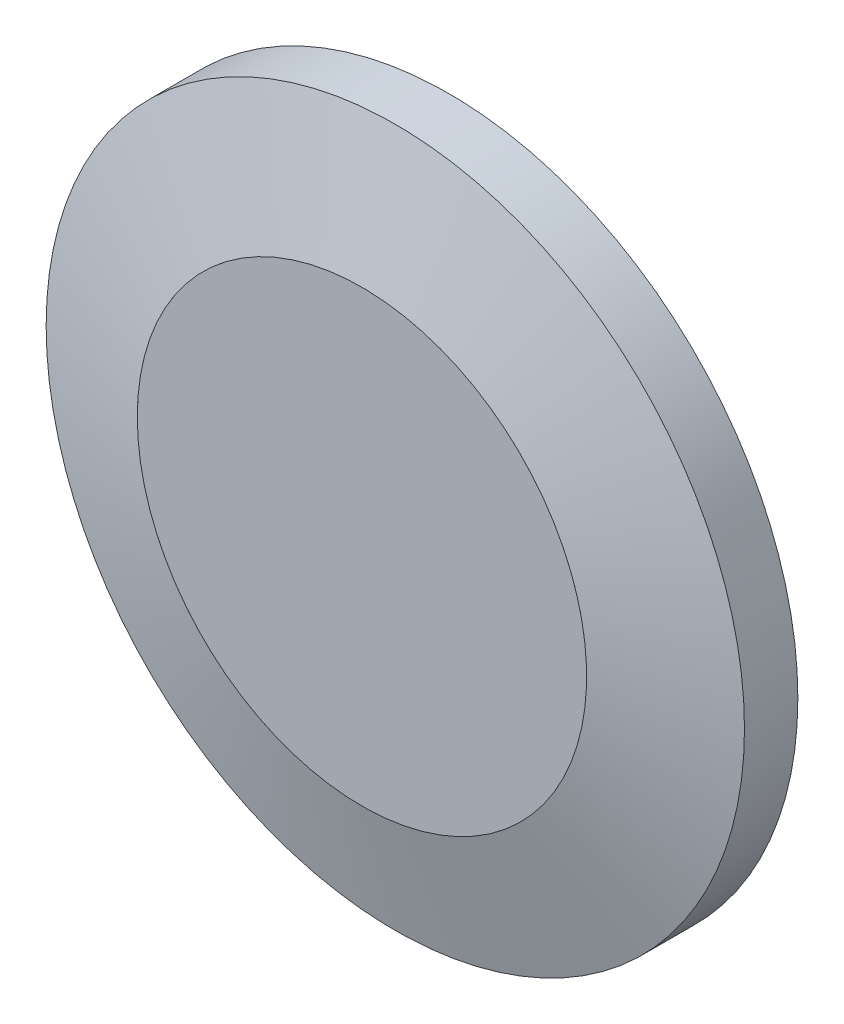
ISO-10303-21;
HEADER;
FILE_DESCRIPTION(('STEP AP214'),'2;1');
FILE_NAME('part.step','',(''),(''),'','','');
FILE_SCHEMA(('AUTOMOTIVE_DESIGN { 1 0 10303 214 1 1 1 1 }'));
ENDSEC;
DATA;
#1=APPLICATION_CONTEXT('core data for automotive mechanical design processes');
#2=APPLICATION_PROTOCOL_DEFINITION('international standard','automotive_design',2000,#1);
#3=PRODUCT_CONTEXT('',#1,'mechanical');
#4=PRODUCT('Part','Part','',(#3));
#5=PRODUCT_RELATED_PRODUCT_CATEGORY('part','',(#4));
#6=PRODUCT_DEFINITION_FORMATION('','',#4);
#7=PRODUCT_DEFINITION_CONTEXT('part definition',#1,'design');
#8=PRODUCT_DEFINITION('design','',#6,#7);
#9=PRODUCT_DEFINITION_SHAPE('','',#8);
#10=(LENGTH_UNIT() NAMED_UNIT(*) SI_UNIT(.MILLI.,.METRE.));
#11=(NAMED_UNIT(*) PLANE_ANGLE_UNIT() SI_UNIT($,.RADIAN.));
#12=(NAMED_UNIT(*) SI_UNIT($,.STERADIAN.) SOLID_ANGLE_UNIT());
#13=UNCERTAINTY_MEASURE_WITH_UNIT(LENGTH_MEASURE(1.E-05),#10,'distance_accuracy_value','');
#14=(GEOMETRIC_REPRESENTATION_CONTEXT(3) GLOBAL_UNCERTAINTY_ASSIGNED_CONTEXT((#13)) GLOBAL_UNIT_ASSIGNED_CONTEXT((#10,
#11,#12)) REPRESENTATION_CONTEXT('',''));
#15=CARTESIAN_POINT('',(0.,0.,0.));
#16=DIRECTION('',(0.,0.,1.));
#17=DIRECTION('',(1.,0.,0.));
#18=AXIS2_PLACEMENT_3D('',#15,#16,#17);
#19=CARTESIAN_POINT('',(0.,0.,2.4765));
#20=DIRECTION('',(0.,0.,-1.));
#21=DIRECTION('',(-1.,0.,0.));
#22=AXIS2_PLACEMENT_3D('',#19,#20,#21);
#23=PLANE('',#22);
#24=CARTESIAN_POINT('',(0.,0.,2.4765));
#25=DIRECTION('',(0.,0.,-1.));
#26=DIRECTION('',(-1.,0.,0.));
#27=AXIS2_PLACEMENT_3D('',#24,#25,#26);
#28=CIRCLE('',#27,12.8294432115813);
#29=CARTESIAN_POINT('',(-12.8294432115813,0.,2.4765));
#30=VERTEX_POINT('',#29);
#31=EDGE_CURVE('E31',#30,#30,#28,.T.);
#32=ORIENTED_EDGE('',*,*,#31,.F.);
#33=EDGE_LOOP('',(#32));
#34=FACE_BOUND('',#33,.T.);
#35=CARTESIAN_POINT('',(0.,0.,2.4765));
#36=DIRECTION('',(0.,0.,-1.));
#37=DIRECTION('',(0.,1.,0.));
#38=AXIS2_PLACEMENT_3D('',#35,#36,#37);
#39=CIRCLE('',#38,12.827);
#40=CARTESIAN_POINT('',(0.,12.827,2.4765));
#41=VERTEX_POINT('',#40);
#42=EDGE_CURVE('E10',#41,#41,#39,.T.);
#43=ORIENTED_EDGE('',*,*,#42,.T.);
#44=EDGE_LOOP('',(#43));
#45=FACE_BOUND('',#44,.T.);
#46=ADVANCED_FACE('F14',(#34,#45),#23,.F.);
#47=CARTESIAN_POINT('',(0.,0.,2.4765));
#48=DIRECTION('',(0.,0.,1.));
#49=DIRECTION('',(-1.,0.,0.));
#50=AXIS2_PLACEMENT_3D('',#47,#48,#49);
#51=CYLINDRICAL_SURFACE('',#50,19.939);
#52=CARTESIAN_POINT('',(0.,0.,-2.4765));
#53=DIRECTION('',(0.,0.,-1.));
#54=DIRECTION('',(1.,0.,0.));
#55=AXIS2_PLACEMENT_3D('',#52,#53,#54);
#56=CIRCLE('',#55,19.939);
#57=CARTESIAN_POINT('',(19.939,0.,-2.4765));
#58=VERTEX_POINT('',#57);
#59=EDGE_CURVE('E32',#58,#58,#56,.T.);
#60=ORIENTED_EDGE('',*,*,#59,.F.);
#61=EDGE_LOOP('',(#60));
#62=FACE_BOUND('',#61,.T.);
#63=CARTESIAN_POINT('',(0.,0.,0.571500000000003));
#64=DIRECTION('',(0.,0.,-1.));
#65=DIRECTION('',(-1.,0.,0.));
#66=AXIS2_PLACEMENT_3D('',#63,#64,#65);
#67=CIRCLE('',#66,19.939);
#68=CARTESIAN_POINT('',(-19.939,0.,0.571500000000003));
#69=VERTEX_POINT('',#68);
#70=EDGE_CURVE('E22',#69,#69,#67,.T.);
#71=ORIENTED_EDGE('',*,*,#70,.T.);
#72=EDGE_LOOP('',(#71));
#73=FACE_BOUND('',#72,.T.);
#74=ADVANCED_FACE('F65',(#62,#73),#51,.T.);
#75=CARTESIAN_POINT('',(0.,0.,1.2065));
#76=DIRECTION('',(0.,0.,-1.));
#77=DIRECTION('',(1.,0.,0.));
#78=AXIS2_PLACEMENT_3D('',#75,#76,#77);
#79=CYLINDRICAL_SURFACE('',#78,12.827);
#80=CARTESIAN_POINT('',(0.,0.,1.2065));
#81=DIRECTION('',(0.,0.,-1.));
#82=DIRECTION('',(0.,1.,0.));
#83=AXIS2_PLACEMENT_3D('',#80,#81,#82);
#84=CIRCLE('',#83,12.827);
#85=CARTESIAN_POINT('',(0.,12.827,1.2065));
#86=VERTEX_POINT('',#85);
#87=EDGE_CURVE('E27',#86,#86,#84,.T.);
#88=ORIENTED_EDGE('',*,*,#87,.T.);
#89=EDGE_LOOP('',(#88));
#90=FACE_BOUND('',#89,.T.);
#91=ORIENTED_EDGE('',*,*,#42,.F.);
#92=EDGE_LOOP('',(#91));
#93=FACE_BOUND('',#92,.T.);
#94=ADVANCED_FACE('F61',(#90,#93),#79,.F.);
#95=CARTESIAN_POINT('',(0.,0.,1.2065));
#96=DIRECTION('',(0.,0.,-1.));
#97=DIRECTION('',(-1.,0.,0.));
#98=AXIS2_PLACEMENT_3D('',#95,#96,#97);
#99=PLANE('',#98);
#100=CARTESIAN_POINT('',(0.,0.,1.2065));
#101=DIRECTION('',(0.,0.,-1.));
#102=DIRECTION('',(-1.,0.,0.));
#103=AXIS2_PLACEMENT_3D('',#100,#101,#102);
#104=CIRCLE('',#103,11.8745);
#105=CARTESIAN_POINT('',(-11.8745,0.,1.2065));
#106=VERTEX_POINT('',#105);
#107=EDGE_CURVE('E38',#106,#106,#104,.T.);
#108=ORIENTED_EDGE('',*,*,#107,.T.);
#109=EDGE_LOOP('',(#108));
#110=FACE_BOUND('',#109,.T.);
#111=ORIENTED_EDGE('',*,*,#87,.F.);
#112=EDGE_LOOP('',(#111));
#113=FACE_BOUND('',#112,.T.);
#114=ADVANCED_FACE('F51',(#110,#113),#99,.F.);
#115=CARTESIAN_POINT('',(0.,0.,0.1905));
#116=DIRECTION('',(0.,0.,1.));
#117=DIRECTION('',(1.,0.,0.));
#118=AXIS2_PLACEMENT_3D('',#115,#116,#117);
#119=PLANE('',#118);
#120=CARTESIAN_POINT('',(0.,0.,0.190500000000003));
#121=DIRECTION('',(0.,0.,1.));
#122=DIRECTION('',(1.,0.,0.));
#123=AXIS2_PLACEMENT_3D('',#120,#121,#122);
#124=CIRCLE('',#123,11.8745);
#125=CARTESIAN_POINT('',(11.8745,0.,0.190500000000003));
#126=VERTEX_POINT('',#125);
#127=EDGE_CURVE('E41',#126,#126,#124,.T.);
#128=ORIENTED_EDGE('',*,*,#127,.T.);
#129=EDGE_LOOP('',(#128));
#130=FACE_BOUND('',#129,.T.);
#131=CARTESIAN_POINT('',(0.,0.,0.1905));
#132=DIRECTION('',(0.,0.,1.));
#133=DIRECTION('',(0.,1.,0.));
#134=AXIS2_PLACEMENT_3D('',#131,#132,#133);
#135=CIRCLE('',#134,13.208);
#136=CARTESIAN_POINT('',(0.,13.208,0.1905));
#137=VERTEX_POINT('',#136);
#138=EDGE_CURVE('E34',#137,#137,#135,.T.);
#139=ORIENTED_EDGE('',*,*,#138,.F.);
#140=EDGE_LOOP('',(#139));
#141=FACE_BOUND('',#140,.T.);
#142=ADVANCED_FACE('F49',(#130,#141),#119,.F.);
#143=CARTESIAN_POINT('',(0.,0.,0.1905));
#144=DIRECTION('',(0.,0.,1.));
#145=DIRECTION('',(-1.,0.,0.));
#146=AXIS2_PLACEMENT_3D('',#143,#144,#145);
#147=CYLINDRICAL_SURFACE('',#146,13.208);
#148=ORIENTED_EDGE('',*,*,#138,.T.);
#149=EDGE_LOOP('',(#148));
#150=FACE_BOUND('',#149,.T.);
#151=CARTESIAN_POINT('',(0.,0.,-2.4765));
#152=DIRECTION('',(0.,0.,1.));
#153=DIRECTION('',(0.,1.,0.));
#154=AXIS2_PLACEMENT_3D('',#151,#152,#153);
#155=CIRCLE('',#154,13.208);
#156=CARTESIAN_POINT('',(0.,13.208,-2.4765));
#157=VERTEX_POINT('',#156);
#158=EDGE_CURVE('E18',#157,#157,#155,.T.);
#159=ORIENTED_EDGE('',*,*,#158,.F.);
#160=EDGE_LOOP('',(#159));
#161=FACE_BOUND('',#160,.T.);
#162=ADVANCED_FACE('F46',(#150,#161),#147,.F.);
#163=CARTESIAN_POINT('',(0.,0.,-2.4765));
#164=DIRECTION('',(0.,0.,-1.));
#165=DIRECTION('',(-1.,0.,0.));
#166=AXIS2_PLACEMENT_3D('',#163,#164,#165);
#167=PLANE('',#166);
#168=ORIENTED_EDGE('',*,*,#59,.T.);
#169=EDGE_LOOP('',(#168));
#170=FACE_BOUND('',#169,.T.);
#171=ORIENTED_EDGE('',*,*,#158,.T.);
#172=EDGE_LOOP('',(#171));
#173=FACE_BOUND('',#172,.T.);
#174=ADVANCED_FACE('F59',(#170,#173),#167,.T.);
#175=CARTESIAN_POINT('',(0.,0.,0.571500000000003));
#176=DIRECTION('',(0.,0.,-1.));
#177=DIRECTION('',(-1.,0.,0.));
#178=AXIS2_PLACEMENT_3D('',#175,#176,#177);
#179=CONICAL_SURFACE('',#178,19.939,1.30899693899575);
#180=ORIENTED_EDGE('',*,*,#31,.T.);
#181=EDGE_LOOP('',(#180));
#182=FACE_BOUND('',#181,.T.);
#183=ORIENTED_EDGE('',*,*,#70,.F.);
#184=EDGE_LOOP('',(#183));
#185=FACE_BOUND('',#184,.T.);
#186=ADVANCED_FACE('F112',(#182,#185),#179,.T.);
#187=CARTESIAN_POINT('',(0.,0.,-54.1365901558994));
#188=DIRECTION('',(0.,0.,-1.));
#189=DIRECTION('',(1.,0.,0.));
#190=AXIS2_PLACEMENT_3D('',#187,#188,#189);
#191=CYLINDRICAL_SURFACE('',#190,11.8745);
#192=ORIENTED_EDGE('',*,*,#107,.F.);
#193=EDGE_LOOP('',(#192));
#194=FACE_BOUND('',#193,.T.);
#195=ORIENTED_EDGE('',*,*,#127,.F.);
#196=EDGE_LOOP('',(#195));
#197=FACE_BOUND('',#196,.T.);
#198=ADVANCED_FACE('F16',(#194,#197),#191,.F.);
#199=CLOSED_SHELL('',(#46,#74,#94,#114,#142,#162,#174,#186,#198));
#200=MANIFOLD_SOLID_BREP('B1',#199);
#201=ADVANCED_BREP_SHAPE_REPRESENTATION('',(#18,#200),#14);
#202=SHAPE_DEFINITION_REPRESENTATION(#9,#201);
ENDSEC;
END-ISO-10303-21;
